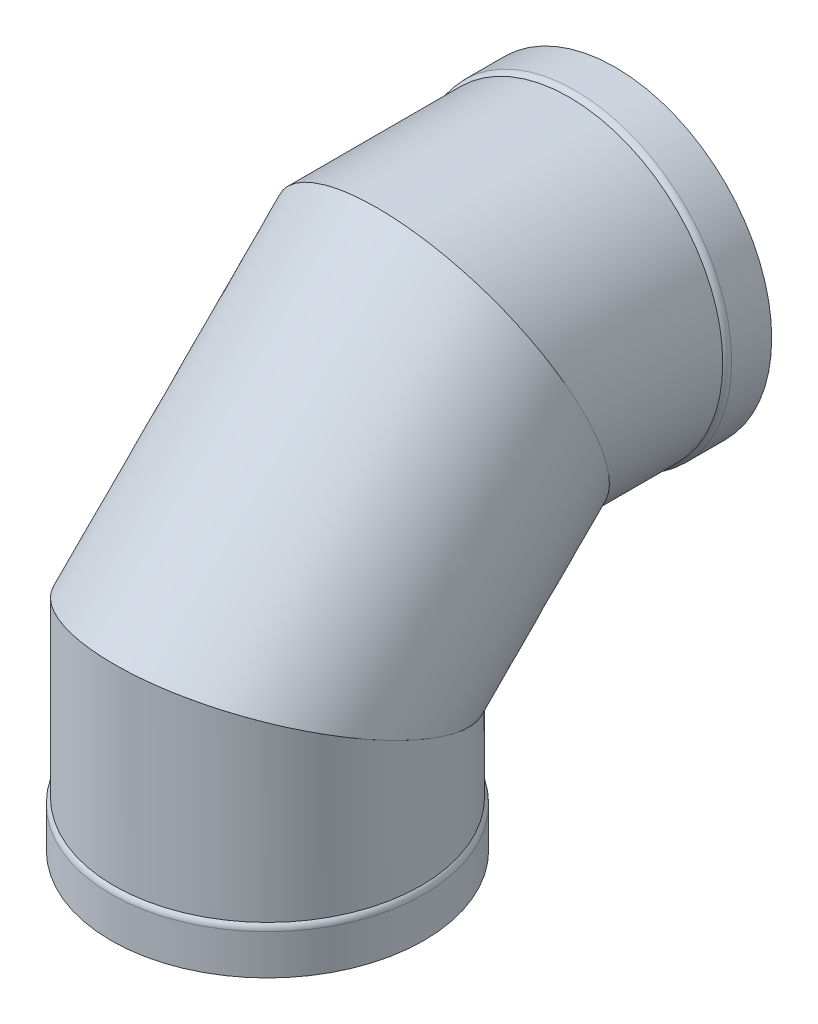
ISO-10303-21;
HEADER;
FILE_DESCRIPTION(('STEP AP214'),'2;1');
FILE_NAME('part.step','',(''),(''),'','','');
FILE_SCHEMA(('AUTOMOTIVE_DESIGN { 1 0 10303 214 1 1 1 1 }'));
ENDSEC;
DATA;
#1=APPLICATION_CONTEXT('core data for automotive mechanical design processes');
#2=APPLICATION_PROTOCOL_DEFINITION('international standard','automotive_design',2000,#1);
#3=PRODUCT_CONTEXT('',#1,'mechanical');
#4=PRODUCT('Part','Part','',(#3));
#5=PRODUCT_RELATED_PRODUCT_CATEGORY('part','',(#4));
#6=PRODUCT_DEFINITION_FORMATION('','',#4);
#7=PRODUCT_DEFINITION_CONTEXT('part definition',#1,'design');
#8=PRODUCT_DEFINITION('design','',#6,#7);
#9=PRODUCT_DEFINITION_SHAPE('','',#8);
#10=(LENGTH_UNIT() NAMED_UNIT(*) SI_UNIT(.MILLI.,.METRE.));
#11=(NAMED_UNIT(*) PLANE_ANGLE_UNIT() SI_UNIT($,.RADIAN.));
#12=(NAMED_UNIT(*) SI_UNIT($,.STERADIAN.) SOLID_ANGLE_UNIT());
#13=UNCERTAINTY_MEASURE_WITH_UNIT(LENGTH_MEASURE(1.E-05),#10,'distance_accuracy_value','');
#14=(GEOMETRIC_REPRESENTATION_CONTEXT(3) GLOBAL_UNCERTAINTY_ASSIGNED_CONTEXT((#13)) GLOBAL_UNIT_ASSIGNED_CONTEXT((#10,
#11,#12)) REPRESENTATION_CONTEXT('',''));
#15=CARTESIAN_POINT('',(0.,0.,0.));
#16=DIRECTION('',(0.,0.,1.));
#17=DIRECTION('',(1.,0.,0.));
#18=AXIS2_PLACEMENT_3D('',#15,#16,#17);
#19=CARTESIAN_POINT('',(0.,575.459925886712,-289.709925886711));
#20=DIRECTION('',(0.,-0.391140640344855,0.920330918458473));
#21=DIRECTION('',(0.,-0.920330918458473,-0.391140640344855));
#22=AXIS2_PLACEMENT_3D('',#19,#20,#21);
#23=PLANE('',#22);
#24=CARTESIAN_POINT('',(0.,575.459925886712,-289.709925886711));
#25=DIRECTION('',(0.,-0.391140640344855,0.920330918458473));
#26=DIRECTION('',(0.,-0.920330918458473,-0.391140640344855));
#27=AXIS2_PLACEMENT_3D('',#24,#25,#26);
#28=ELLIPSE('',#27,270.812916312173,249.2375);
#29=CARTESIAN_POINT('',(0.,326.222425886713,-395.635863386712));
#30=VERTEX_POINT('',#29);
#31=EDGE_CURVE('E90',#30,#30,#28,.T.);
#32=ORIENTED_EDGE('',*,*,#31,.T.);
#33=EDGE_LOOP('',(#32));
#34=FACE_BOUND('',#33,.T.);
#35=CARTESIAN_POINT('',(0.,575.459925886712,-289.709925886711));
#36=DIRECTION('',(0.,-0.391140640344855,0.920330918458473));
#37=DIRECTION('',(0.,-0.920330918458473,-0.391140640344855));
#38=AXIS2_PLACEMENT_3D('',#35,#36,#37);
#39=ELLIPSE('',#38,275.987685413679,254.);
#40=CARTESIAN_POINT('',(0.,321.459925886713,-397.659925886712));
#41=VERTEX_POINT('',#40);
#42=EDGE_CURVE('E12',#41,#41,#39,.T.);
#43=ORIENTED_EDGE('',*,*,#42,.F.);
#44=EDGE_LOOP('',(#43));
#45=FACE_BOUND('',#44,.T.);
#46=ADVANCED_FACE('F73',(#34,#45),#23,.F.);
#47=CARTESIAN_POINT('',(0.,285.75,0.));
#48=DIRECTION('',(0.,0.920330918458475,-0.391140640344852));
#49=DIRECTION('',(0.,0.391140640344852,0.920330918458475));
#50=AXIS2_PLACEMENT_3D('',#47,#48,#49);
#51=PLANE('',#50);
#52=CARTESIAN_POINT('',(0.,285.75,0.));
#53=DIRECTION('',(0.,0.920330918458475,-0.391140640344852));
#54=DIRECTION('',(0.,-0.391140640344852,-0.920330918458475));
#55=AXIS2_PLACEMENT_3D('',#52,#53,#54);
#56=ELLIPSE('',#55,270.812916312173,249.2375);
#57=CARTESIAN_POINT('',(0.,179.8240625,-249.2375));
#58=VERTEX_POINT('',#57);
#59=EDGE_CURVE('E104',#58,#58,#56,.T.);
#60=ORIENTED_EDGE('',*,*,#59,.T.);
#61=EDGE_LOOP('',(#60));
#62=FACE_BOUND('',#61,.T.);
#63=CARTESIAN_POINT('',(0.,285.75,0.));
#64=DIRECTION('',(0.,0.920330918458475,-0.391140640344852));
#65=DIRECTION('',(0.,-0.391140640344852,-0.920330918458475));
#66=AXIS2_PLACEMENT_3D('',#63,#64,#65);
#67=ELLIPSE('',#66,275.987685413679,254.);
#68=CARTESIAN_POINT('',(0.,177.8,-254.));
#69=VERTEX_POINT('',#68);
#70=EDGE_CURVE('E82',#69,#69,#67,.T.);
#71=ORIENTED_EDGE('',*,*,#70,.F.);
#72=EDGE_LOOP('',(#71));
#73=FACE_BOUND('',#72,.T.);
#74=ADVANCED_FACE('F112',(#62,#73),#51,.F.);
#75=CARTESIAN_POINT('',(0.0318294970354893,393.699999152412,253.999998005675));
#76=CARTESIAN_POINT('',(0.102296091397399,829.459905287321,-181.759934641451));
#77=CARTESIAN_POINT('',(508.031825508387,393.672944079932,253.936339011605));
#78=CARTESIAN_POINT('',(508.102254892615,829.255313104526,-181.846886319139));
#79=CARTESIAN_POINT('',(507.968166514315,177.772945775108,-254.063656999747));
#80=CARTESIAN_POINT('',(507.89766270982,321.255354303309,-397.746868809659));
#81=CARTESIAN_POINT('',(-0.0318294970356332,177.800000847588,-253.999998005675));
#82=CARTESIAN_POINT('',(-0.10229609139743,321.459946486104,-397.659917131971));
#83=CARTESIAN_POINT('',(-508.031825508386,177.827055920068,-253.936339011604));
#84=CARTESIAN_POINT('',(-508.102254892615,321.664538668899,-397.572965454283));
#85=CARTESIAN_POINT('',(-507.968166514315,393.727054224892,254.063656999747));
#86=CARTESIAN_POINT('',(-507.89766270982,829.664497470116,-181.672982963764));
#87=CARTESIAN_POINT('',(0.0318294970354893,393.699999152412,253.999998005675));
#88=CARTESIAN_POINT('',(0.102296091397399,829.459905287321,-181.759934641451));
#89=(BOUNDED_SURFACE() B_SPLINE_SURFACE(3,1,((#75,#76),(#77,#78),(#79,#80),(#81,#82),(#83,#84),
(#85,#86),(#87,#88)),.UNSPECIFIED.,.T.,.F.,.F.) B_SPLINE_SURFACE_WITH_KNOTS((4,3,4),(2,2),(0.,
0.5,1.),(0.,1.),.UNSPECIFIED.) GEOMETRIC_REPRESENTATION_ITEM() RATIONAL_B_SPLINE_SURFACE(((1.,
1.),(0.333333333333333,0.333333333333333),(0.333333333333333,0.333333333333333),(1.,1.),
(0.333333333333333,0.333333333333333),(0.333333333333333,0.333333333333333),(1.,1.))) REPRESENTATION_ITEM('') SURFACE());
#90=ORIENTED_EDGE('',*,*,#70,.T.);
#91=EDGE_LOOP('',(#90));
#92=FACE_BOUND('',#91,.T.);
#93=ORIENTED_EDGE('',*,*,#42,.T.);
#94=EDGE_LOOP('',(#93));
#95=FACE_BOUND('',#94,.T.);
#96=ADVANCED_FACE('F132',(#92,#95),#89,.T.);
#97=CARTESIAN_POINT('',(0.,179.8240625,-249.2375));
#98=CARTESIAN_POINT('',(0.,326.222425886713,-395.635863386712));
#99=CARTESIAN_POINT('',(-498.475,179.8240625,-249.2375));
#100=CARTESIAN_POINT('',(-498.475,326.222425886713,-395.635863386712));
#101=CARTESIAN_POINT('',(-498.475,391.6759375,249.2375));
#102=CARTESIAN_POINT('',(-498.475,824.697425886712,-183.78398838671));
#103=CARTESIAN_POINT('',(0.,391.6759375,249.2375));
#104=CARTESIAN_POINT('',(0.,824.697425886712,-183.78398838671));
#105=CARTESIAN_POINT('',(498.475,391.6759375,249.2375));
#106=CARTESIAN_POINT('',(498.475,824.697425886712,-183.78398838671));
#107=CARTESIAN_POINT('',(498.475,179.8240625,-249.2375));
#108=CARTESIAN_POINT('',(498.475,326.222425886713,-395.635863386712));
#109=CARTESIAN_POINT('',(0.,179.8240625,-249.2375));
#110=CARTESIAN_POINT('',(0.,326.222425886713,-395.635863386712));
#111=(BOUNDED_SURFACE() B_SPLINE_SURFACE(3,1,((#97,#98),(#99,#100),(#101,#102),(#103,#104),
(#105,#106),(#107,#108),(#109,#110)),.UNSPECIFIED.,.T.,.F.,.F.) B_SPLINE_SURFACE_WITH_KNOTS((4,
3,4),(2,2),(0.,0.5,1.),(0.,1.),
.UNSPECIFIED.) GEOMETRIC_REPRESENTATION_ITEM() RATIONAL_B_SPLINE_SURFACE(((1.,1.),
(0.333333333333333,0.333333333333333),(0.333333333333333,0.333333333333333),(1.,1.),
(0.333333333333333,0.333333333333333),(0.333333333333333,0.333333333333333),(1.,1.))) REPRESENTATION_ITEM('') SURFACE());
#112=ORIENTED_EDGE('',*,*,#59,.F.);
#113=EDGE_LOOP('',(#112));
#114=FACE_BOUND('',#113,.T.);
#115=ORIENTED_EDGE('',*,*,#31,.F.);
#116=EDGE_LOOP('',(#115));
#117=FACE_BOUND('',#116,.T.);
#118=ADVANCED_FACE('F133',(#114,#117),#111,.F.);
#119=CLOSED_SHELL('',(#46,#74,#96,#118));
#120=MANIFOLD_SOLID_BREP('B2',#119);
#121=CARTESIAN_POINT('',(0.,575.459925886714,-627.573718990159));
#122=DIRECTION('',(0.,0.,-1.));
#123=DIRECTION('',(0.,-1.,0.));
#124=AXIS2_PLACEMENT_3D('',#121,#122,#123);
#125=CYLINDRICAL_SURFACE('',#124,254.);
#126=CARTESIAN_POINT('',(0.,575.459925886713,-499.259925886711));
#127=DIRECTION('',(0.,0.,1.));
#128=DIRECTION('',(0.,-1.,0.));
#129=AXIS2_PLACEMENT_3D('',#126,#127,#128);
#130=CIRCLE('',#129,254.);
#131=CARTESIAN_POINT('',(0.,321.459925886713,-499.259925886712));
#132=VERTEX_POINT('',#131);
#133=EDGE_CURVE('E273',#132,#132,#130,.T.);
#134=ORIENTED_EDGE('',*,*,#133,.T.);
#135=EDGE_LOOP('',(#134));
#136=FACE_BOUND('',#135,.T.);
#137=CARTESIAN_POINT('',(0.,575.459925886712,-289.709925886711));
#138=DIRECTION('',(0.,-0.391140640344855,0.920330918458473));
#139=DIRECTION('',(0.,-0.920330918458473,-0.391140640344855));
#140=AXIS2_PLACEMENT_3D('',#137,#138,#139);
#141=ELLIPSE('',#140,275.987685413679,254.);
#142=CARTESIAN_POINT('',(0.,321.459925886713,-397.659925886712));
#143=VERTEX_POINT('',#142);
#144=EDGE_CURVE('E285',#143,#143,#141,.T.);
#145=ORIENTED_EDGE('',*,*,#144,.F.);
#146=EDGE_LOOP('',(#145));
#147=FACE_BOUND('',#146,.T.);
#148=ADVANCED_FACE('F259',(#136,#147),#125,.T.);
#149=CARTESIAN_POINT('',(0.,575.459925886714,-627.573718990159));
#150=DIRECTION('',(0.,0.,-1.));
#151=DIRECTION('',(0.,-1.,0.));
#152=AXIS2_PLACEMENT_3D('',#149,#150,#151);
#153=CYLINDRICAL_SURFACE('',#152,258.7625);
#154=CARTESIAN_POINT('',(0.,575.459925886713,-509.173860209169));
#155=DIRECTION('',(0.,0.,1.));
#156=DIRECTION('',(0.,-1.,0.));
#157=AXIS2_PLACEMENT_3D('',#154,#155,#156);
#158=CIRCLE('',#157,258.7625);
#159=CARTESIAN_POINT('',(0.,316.697425886713,-509.17386020917));
#160=VERTEX_POINT('',#159);
#161=EDGE_CURVE('E267',#160,#160,#158,.F.);
#162=ORIENTED_EDGE('',*,*,#161,.T.);
#163=EDGE_LOOP('',(#162));
#164=FACE_BOUND('',#163,.T.);
#165=CARTESIAN_POINT('',(0.,575.459925886713,-575.459925886711));
#166=DIRECTION('',(0.,0.,1.));
#167=DIRECTION('',(0.,-1.,0.));
#168=AXIS2_PLACEMENT_3D('',#165,#166,#167);
#169=CIRCLE('',#168,258.7625);
#170=CARTESIAN_POINT('',(0.,316.697425886713,-575.459925886712));
#171=VERTEX_POINT('',#170);
#172=EDGE_CURVE('E279',#171,#171,#169,.T.);
#173=ORIENTED_EDGE('',*,*,#172,.T.);
#174=EDGE_LOOP('',(#173));
#175=FACE_BOUND('',#174,.T.);
#176=ADVANCED_FACE('F306',(#164,#175),#153,.T.);
#177=CARTESIAN_POINT('',(0.,834.222425886713,-575.45992588671));
#178=DIRECTION('',(0.,0.,1.));
#179=DIRECTION('',(0.,1.,0.));
#180=AXIS2_PLACEMENT_3D('',#177,#178,#179);
#181=PLANE('',#180);
#182=CARTESIAN_POINT('',(0.,575.459925886713,-575.459925886711));
#183=DIRECTION('',(0.,0.,1.));
#184=DIRECTION('',(0.,-1.,0.));
#185=AXIS2_PLACEMENT_3D('',#182,#183,#184);
#186=CIRCLE('',#185,254.);
#187=CARTESIAN_POINT('',(0.,321.459925886713,-575.459925886712));
#188=VERTEX_POINT('',#187);
#189=EDGE_CURVE('E290',#188,#188,#186,.T.);
#190=ORIENTED_EDGE('',*,*,#189,.T.);
#191=EDGE_LOOP('',(#190));
#192=FACE_BOUND('',#191,.T.);
#193=ORIENTED_EDGE('',*,*,#172,.F.);
#194=EDGE_LOOP('',(#193));
#195=FACE_BOUND('',#194,.T.);
#196=ADVANCED_FACE('F312',(#192,#195),#181,.F.);
#197=CARTESIAN_POINT('',(0.,575.459925886714,-627.573718990159));
#198=DIRECTION('',(0.,0.,-1.));
#199=DIRECTION('',(0.,-1.,0.));
#200=AXIS2_PLACEMENT_3D('',#197,#198,#199);
#201=CYLINDRICAL_SURFACE('',#200,254.);
#202=CARTESIAN_POINT('',(0.,575.459925886713,-513.936360209169));
#203=DIRECTION('',(0.,0.,1.));
#204=DIRECTION('',(0.,-1.,0.));
#205=AXIS2_PLACEMENT_3D('',#202,#203,#204);
#206=CIRCLE('',#205,254.);
#207=CARTESIAN_POINT('',(0.,321.459925886713,-513.93636020917));
#208=VERTEX_POINT('',#207);
#209=EDGE_CURVE('E72',#208,#208,#206,.T.);
#210=ORIENTED_EDGE('',*,*,#209,.T.);
#211=EDGE_LOOP('',(#210));
#212=FACE_BOUND('',#211,.T.);
#213=ORIENTED_EDGE('',*,*,#189,.F.);
#214=EDGE_LOOP('',(#213));
#215=FACE_BOUND('',#214,.T.);
#216=ADVANCED_FACE('F331',(#212,#215),#201,.F.);
#217=CARTESIAN_POINT('',(0.,575.459925886714,-627.573718990159));
#218=DIRECTION('',(0.,0.,-1.));
#219=DIRECTION('',(0.,-1.,0.));
#220=AXIS2_PLACEMENT_3D('',#217,#218,#219);
#221=CYLINDRICAL_SURFACE('',#220,249.2375);
#222=CARTESIAN_POINT('',(0.,575.459925886712,-289.709925886711));
#223=DIRECTION('',(0.,-0.391140640344855,0.920330918458473));
#224=DIRECTION('',(0.,-0.920330918458473,-0.391140640344855));
#225=AXIS2_PLACEMENT_3D('',#222,#223,#224);
#226=ELLIPSE('',#225,270.812916312173,249.2375);
#227=CARTESIAN_POINT('',(0.,326.222425886713,-395.635863386712));
#228=VERTEX_POINT('',#227);
#229=EDGE_CURVE('E282',#228,#228,#226,.F.);
#230=ORIENTED_EDGE('',*,*,#229,.F.);
#231=EDGE_LOOP('',(#230));
#232=FACE_BOUND('',#231,.T.);
#233=CARTESIAN_POINT('',(0.,575.459925886713,-504.022425886711));
#234=DIRECTION('',(0.,0.,1.));
#235=DIRECTION('',(0.,-1.,0.));
#236=AXIS2_PLACEMENT_3D('',#233,#234,#235);
#237=CIRCLE('',#236,249.2375);
#238=CARTESIAN_POINT('',(0.,326.222425886713,-504.022425886712));
#239=VERTEX_POINT('',#238);
#240=EDGE_CURVE('E294',#239,#239,#237,.T.);
#241=ORIENTED_EDGE('',*,*,#240,.F.);
#242=EDGE_LOOP('',(#241));
#243=FACE_BOUND('',#242,.T.);
#244=ADVANCED_FACE('F323',(#232,#243),#221,.F.);
#245=CARTESIAN_POINT('',(-258.7625,829.459925886712,-181.75992588671));
#246=DIRECTION('',(0.,0.391140640344855,-0.920330918458473));
#247=DIRECTION('',(0.,-0.920330918458473,-0.391140640344855));
#248=AXIS2_PLACEMENT_3D('',#245,#246,#247);
#249=PLANE('',#248);
#250=ORIENTED_EDGE('',*,*,#229,.T.);
#251=EDGE_LOOP('',(#250));
#252=FACE_BOUND('',#251,.T.);
#253=ORIENTED_EDGE('',*,*,#144,.T.);
#254=EDGE_LOOP('',(#253));
#255=FACE_BOUND('',#254,.T.);
#256=ADVANCED_FACE('F303',(#252,#255),#249,.F.);
#257=CARTESIAN_POINT('',(0.,575.459925886713,-509.173860209169));
#258=DIRECTION('',(0.,0.,1.));
#259=DIRECTION('',(0.,-1.,0.));
#260=AXIS2_PLACEMENT_3D('',#257,#258,#259);
#261=TOROIDAL_SURFACE('',#260,246.0625,12.7);
#262=ORIENTED_EDGE('',*,*,#161,.F.);
#263=EDGE_LOOP('',(#262));
#264=FACE_BOUND('',#263,.T.);
#265=ORIENTED_EDGE('',*,*,#133,.F.);
#266=EDGE_LOOP('',(#265));
#267=FACE_BOUND('',#266,.T.);
#268=ADVANCED_FACE('F315',(#264,#267),#261,.T.);
#269=CARTESIAN_POINT('',(0.,575.459925886713,-513.936360209169));
#270=DIRECTION('',(0.,0.,1.));
#271=DIRECTION('',(0.,-1.,0.));
#272=AXIS2_PLACEMENT_3D('',#269,#270,#271);
#273=TOROIDAL_SURFACE('',#272,241.3,12.7);
#274=ORIENTED_EDGE('',*,*,#240,.T.);
#275=EDGE_LOOP('',(#274));
#276=FACE_BOUND('',#275,.T.);
#277=ORIENTED_EDGE('',*,*,#209,.F.);
#278=EDGE_LOOP('',(#277));
#279=FACE_BOUND('',#278,.T.);
#280=ADVANCED_FACE('F261',(#276,#279),#273,.F.);
#281=CLOSED_SHELL('',(#148,#176,#196,#216,#244,#256,#268,#280));
#282=MANIFOLD_SOLID_BREP('B7',#281);
#283=CARTESIAN_POINT('',(0.,-52.1137931034483,0.));
#284=DIRECTION('',(0.,-1.,0.));
#285=DIRECTION('',(0.,0.,-1.));
#286=AXIS2_PLACEMENT_3D('',#283,#284,#285);
#287=CYLINDRICAL_SURFACE('',#286,254.);
#288=CARTESIAN_POINT('',(0.,76.2,0.));
#289=DIRECTION('',(0.,-1.,0.));
#290=DIRECTION('',(0.,0.,-1.));
#291=AXIS2_PLACEMENT_3D('',#288,#289,#290);
#292=CIRCLE('',#291,254.);
#293=CARTESIAN_POINT('',(0.,76.2,-254.));
#294=VERTEX_POINT('',#293);
#295=EDGE_CURVE('E426',#294,#294,#292,.T.);
#296=ORIENTED_EDGE('',*,*,#295,.F.);
#297=EDGE_LOOP('',(#296));
#298=FACE_BOUND('',#297,.T.);
#299=CARTESIAN_POINT('',(0.,285.75,0.));
#300=DIRECTION('',(0.,-0.920330918458475,0.391140640344852));
#301=DIRECTION('',(0.,-0.391140640344852,-0.920330918458475));
#302=AXIS2_PLACEMENT_3D('',#299,#300,#301);
#303=ELLIPSE('',#302,275.987685413679,254.);
#304=CARTESIAN_POINT('',(0.,177.8,-254.));
#305=VERTEX_POINT('',#304);
#306=EDGE_CURVE('E438',#305,#305,#303,.T.);
#307=ORIENTED_EDGE('',*,*,#306,.T.);
#308=EDGE_LOOP('',(#307));
#309=FACE_BOUND('',#308,.T.);
#310=ADVANCED_FACE('F412',(#298,#309),#287,.T.);
#311=CARTESIAN_POINT('',(0.,-52.1137931034483,0.));
#312=DIRECTION('',(0.,-1.,0.));
#313=DIRECTION('',(0.,0.,-1.));
#314=AXIS2_PLACEMENT_3D('',#311,#312,#313);
#315=CYLINDRICAL_SURFACE('',#314,258.7625);
#316=CARTESIAN_POINT('',(0.,66.2860656775425,0.));
#317=DIRECTION('',(0.,1.,0.));
#318=DIRECTION('',(0.,0.,1.));
#319=AXIS2_PLACEMENT_3D('',#316,#317,#318);
#320=CIRCLE('',#319,258.7625);
#321=CARTESIAN_POINT('',(0.,66.2860656775425,258.7625));
#322=VERTEX_POINT('',#321);
#323=EDGE_CURVE('E258',#322,#322,#320,.F.);
#324=ORIENTED_EDGE('',*,*,#323,.T.);
#325=EDGE_LOOP('',(#324));
#326=FACE_BOUND('',#325,.T.);
#327=CARTESIAN_POINT('',(0.,0.,0.));
#328=DIRECTION('',(0.,-1.,0.));
#329=DIRECTION('',(0.,0.,-1.));
#330=AXIS2_PLACEMENT_3D('',#327,#328,#329);
#331=CIRCLE('',#330,258.7625);
#332=CARTESIAN_POINT('',(0.,0.,-258.7625));
#333=VERTEX_POINT('',#332);
#334=EDGE_CURVE('E432',#333,#333,#331,.T.);
#335=ORIENTED_EDGE('',*,*,#334,.F.);
#336=EDGE_LOOP('',(#335));
#337=FACE_BOUND('',#336,.T.);
#338=ADVANCED_FACE('F473',(#326,#337),#315,.T.);
#339=CARTESIAN_POINT('',(0.,0.,258.7625));
#340=DIRECTION('',(0.,1.,0.));
#341=DIRECTION('',(0.,0.,1.));
#342=AXIS2_PLACEMENT_3D('',#339,#340,#341);
#343=PLANE('',#342);
#344=CARTESIAN_POINT('',(0.,0.,0.));
#345=DIRECTION('',(0.,-1.,0.));
#346=DIRECTION('',(0.,0.,-1.));
#347=AXIS2_PLACEMENT_3D('',#344,#345,#346);
#348=CIRCLE('',#347,254.);
#349=CARTESIAN_POINT('',(0.,0.,-254.));
#350=VERTEX_POINT('',#349);
#351=EDGE_CURVE('E443',#350,#350,#348,.T.);
#352=ORIENTED_EDGE('',*,*,#351,.F.);
#353=EDGE_LOOP('',(#352));
#354=FACE_BOUND('',#353,.T.);
#355=ORIENTED_EDGE('',*,*,#334,.T.);
#356=EDGE_LOOP('',(#355));
#357=FACE_BOUND('',#356,.T.);
#358=ADVANCED_FACE('F479',(#354,#357),#343,.F.);
#359=CARTESIAN_POINT('',(0.,-52.1137931034483,0.));
#360=DIRECTION('',(0.,-1.,0.));
#361=DIRECTION('',(0.,0.,-1.));
#362=AXIS2_PLACEMENT_3D('',#359,#360,#361);
#363=CYLINDRICAL_SURFACE('',#362,254.);
#364=CARTESIAN_POINT('',(0.,61.5235656775425,0.));
#365=DIRECTION('',(0.,1.,0.));
#366=DIRECTION('',(0.,0.,1.));
#367=AXIS2_PLACEMENT_3D('',#364,#365,#366);
#368=CIRCLE('',#367,254.);
#369=CARTESIAN_POINT('',(0.,61.5235656775425,254.));
#370=VERTEX_POINT('',#369);
#371=EDGE_CURVE('E420',#370,#370,#368,.T.);
#372=ORIENTED_EDGE('',*,*,#371,.T.);
#373=EDGE_LOOP('',(#372));
#374=FACE_BOUND('',#373,.T.);
#375=ORIENTED_EDGE('',*,*,#351,.T.);
#376=EDGE_LOOP('',(#375));
#377=FACE_BOUND('',#376,.T.);
#378=ADVANCED_FACE('F468',(#374,#377),#363,.F.);
#379=CARTESIAN_POINT('',(0.,-52.1137931034483,0.));
#380=DIRECTION('',(0.,-1.,0.));
#381=DIRECTION('',(0.,0.,-1.));
#382=AXIS2_PLACEMENT_3D('',#379,#380,#381);
#383=CYLINDRICAL_SURFACE('',#382,249.2375);
#384=CARTESIAN_POINT('',(0.,285.75,0.));
#385=DIRECTION('',(0.,-0.920330918458475,0.391140640344852));
#386=DIRECTION('',(0.,-0.391140640344852,-0.920330918458475));
#387=AXIS2_PLACEMENT_3D('',#384,#385,#386);
#388=ELLIPSE('',#387,270.812916312173,249.2375);
#389=CARTESIAN_POINT('',(0.,179.8240625,-249.2375));
#390=VERTEX_POINT('',#389);
#391=EDGE_CURVE('E435',#390,#390,#388,.F.);
#392=ORIENTED_EDGE('',*,*,#391,.T.);
#393=EDGE_LOOP('',(#392));
#394=FACE_BOUND('',#393,.T.);
#395=CARTESIAN_POINT('',(0.,71.4375,0.));
#396=DIRECTION('',(0.,-1.,0.));
#397=DIRECTION('',(0.,0.,-1.));
#398=AXIS2_PLACEMENT_3D('',#395,#396,#397);
#399=CIRCLE('',#398,249.2375);
#400=CARTESIAN_POINT('',(0.,71.4375,-249.2375));
#401=VERTEX_POINT('',#400);
#402=EDGE_CURVE('E447',#401,#401,#399,.T.);
#403=ORIENTED_EDGE('',*,*,#402,.T.);
#404=EDGE_LOOP('',(#403));
#405=FACE_BOUND('',#404,.T.);
#406=ADVANCED_FACE('F460',(#394,#405),#383,.F.);
#407=CARTESIAN_POINT('',(-258.7625,393.7,254.));
#408=DIRECTION('',(0.,-0.920330918458475,0.391140640344852));
#409=DIRECTION('',(0.,-0.391140640344852,-0.920330918458475));
#410=AXIS2_PLACEMENT_3D('',#407,#408,#409);
#411=PLANE('',#410);
#412=ORIENTED_EDGE('',*,*,#391,.F.);
#413=EDGE_LOOP('',(#412));
#414=FACE_BOUND('',#413,.T.);
#415=ORIENTED_EDGE('',*,*,#306,.F.);
#416=EDGE_LOOP('',(#415));
#417=FACE_BOUND('',#416,.T.);
#418=ADVANCED_FACE('F457',(#414,#417),#411,.F.);
#419=CARTESIAN_POINT('',(0.,61.5235656775425,0.));
#420=DIRECTION('',(0.,1.,0.));
#421=DIRECTION('',(0.,0.,1.));
#422=AXIS2_PLACEMENT_3D('',#419,#420,#421);
#423=TOROIDAL_SURFACE('',#422,241.3,12.7);
#424=ORIENTED_EDGE('',*,*,#371,.F.);
#425=EDGE_LOOP('',(#424));
#426=FACE_BOUND('',#425,.T.);
#427=ORIENTED_EDGE('',*,*,#402,.F.);
#428=EDGE_LOOP('',(#427));
#429=FACE_BOUND('',#428,.T.);
#430=ADVANCED_FACE('F459',(#426,#429),#423,.F.);
#431=CARTESIAN_POINT('',(0.,66.2860656775425,0.));
#432=DIRECTION('',(0.,1.,0.));
#433=DIRECTION('',(0.,0.,1.));
#434=AXIS2_PLACEMENT_3D('',#431,#432,#433);
#435=TOROIDAL_SURFACE('',#434,246.0625,12.7);
#436=ORIENTED_EDGE('',*,*,#295,.T.);
#437=EDGE_LOOP('',(#436));
#438=FACE_BOUND('',#437,.T.);
#439=ORIENTED_EDGE('',*,*,#323,.F.);
#440=EDGE_LOOP('',(#439));
#441=FACE_BOUND('',#440,.T.);
#442=ADVANCED_FACE('F414',(#438,#441),#435,.T.);
#443=CLOSED_SHELL('',(#310,#338,#358,#378,#406,#418,#430,#442));
#444=MANIFOLD_SOLID_BREP('B67',#443);
#445=ADVANCED_BREP_SHAPE_REPRESENTATION('',(#18,#120,#282,#444),#14);
#446=SHAPE_DEFINITION_REPRESENTATION(#9,#445);
ENDSEC;
END-ISO-10303-21;
